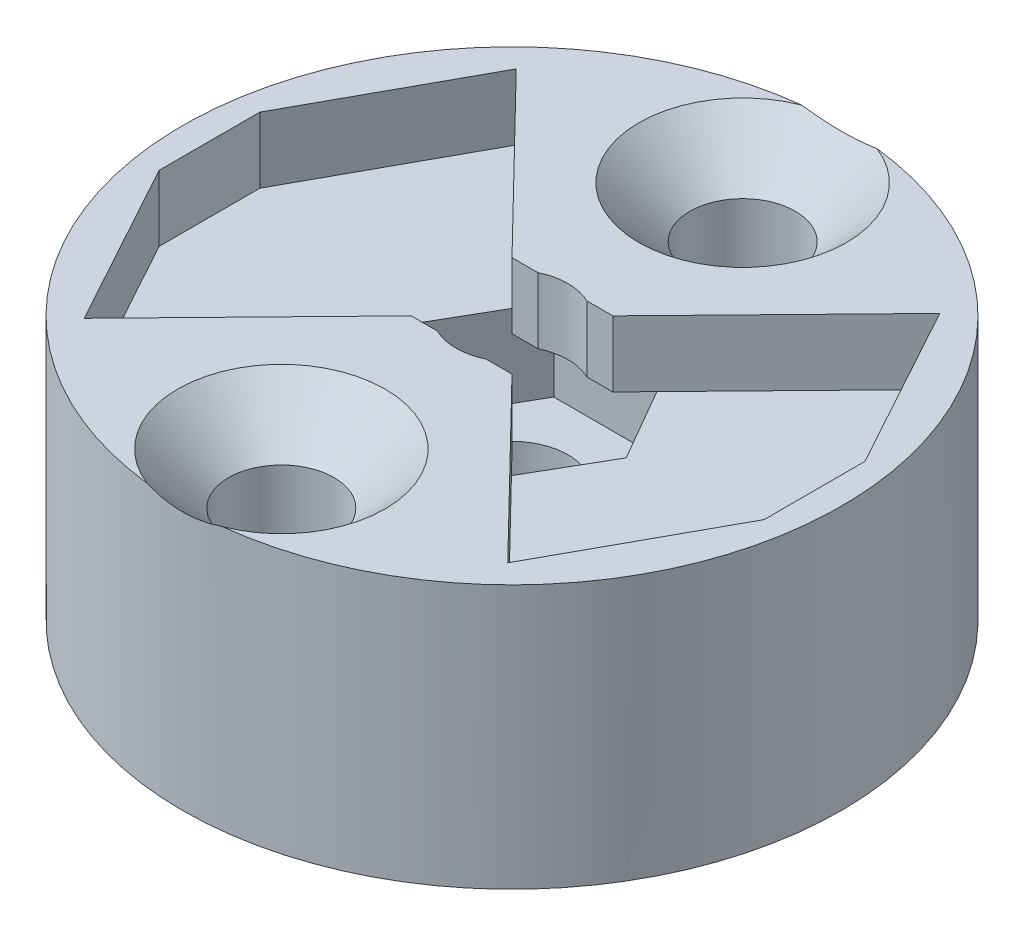
ISO-10303-21;
HEADER;
FILE_DESCRIPTION(('STEP AP214'),'2;1');
FILE_NAME('part.step','',(''),(''),'','','');
FILE_SCHEMA(('AUTOMOTIVE_DESIGN { 1 0 10303 214 1 1 1 1 }'));
ENDSEC;
DATA;
#1=APPLICATION_CONTEXT('core data for automotive mechanical design processes');
#2=APPLICATION_PROTOCOL_DEFINITION('international standard','automotive_design',2000,#1);
#3=PRODUCT_CONTEXT('',#1,'mechanical');
#4=PRODUCT('Part','Part','',(#3));
#5=PRODUCT_RELATED_PRODUCT_CATEGORY('part','',(#4));
#6=PRODUCT_DEFINITION_FORMATION('','',#4);
#7=PRODUCT_DEFINITION_CONTEXT('part definition',#1,'design');
#8=PRODUCT_DEFINITION('design','',#6,#7);
#9=PRODUCT_DEFINITION_SHAPE('','',#8);
#10=(LENGTH_UNIT() NAMED_UNIT(*) SI_UNIT(.MILLI.,.METRE.));
#11=(NAMED_UNIT(*) PLANE_ANGLE_UNIT() SI_UNIT($,.RADIAN.));
#12=(NAMED_UNIT(*) SI_UNIT($,.STERADIAN.) SOLID_ANGLE_UNIT());
#13=UNCERTAINTY_MEASURE_WITH_UNIT(LENGTH_MEASURE(1.E-05),#10,'distance_accuracy_value','');
#14=(GEOMETRIC_REPRESENTATION_CONTEXT(3) GLOBAL_UNCERTAINTY_ASSIGNED_CONTEXT((#13)) GLOBAL_UNIT_ASSIGNED_CONTEXT((#10,
#11,#12)) REPRESENTATION_CONTEXT('',''));
#15=CARTESIAN_POINT('',(0.,0.,0.));
#16=DIRECTION('',(0.,0.,1.));
#17=DIRECTION('',(1.,0.,0.));
#18=AXIS2_PLACEMENT_3D('',#15,#16,#17);
#19=CARTESIAN_POINT('',(1.53,6.,-1.53));
#20=DIRECTION('',(0.,0.,-1.));
#21=DIRECTION('',(-1.,0.,0.));
#22=AXIS2_PLACEMENT_3D('',#19,#20,#21);
#23=PLANE('',#22);
#24=DIRECTION('',(-1.,0.,0.));
#25=VECTOR('',#24,1.);
#26=CARTESIAN_POINT('',(1.53,6.,-1.53));
#27=LINE('',#26,#25);
#28=CARTESIAN_POINT('',(-0.741012820401914,6.,-1.53));
#29=VERTEX_POINT('',#28);
#30=CARTESIAN_POINT('',(-1.53,6.,-1.53));
#31=VERTEX_POINT('',#30);
#32=EDGE_CURVE('E271',#29,#31,#27,.T.);
#33=ORIENTED_EDGE('',*,*,#32,.F.);
#34=DIRECTION('',(0.,1.,0.));
#35=VECTOR('',#34,1.);
#36=CARTESIAN_POINT('',(-0.741012820401914,-0.999999999999999,-1.53));
#37=LINE('',#36,#35);
#38=CARTESIAN_POINT('',(-0.741012820401914,8.,-1.53));
#39=VERTEX_POINT('',#38);
#40=EDGE_CURVE('E668',#29,#39,#37,.T.);
#41=ORIENTED_EDGE('',*,*,#40,.T.);
#42=DIRECTION('',(-1.,0.,0.));
#43=VECTOR('',#42,1.);
#44=CARTESIAN_POINT('',(1.53,8.,-1.53));
#45=LINE('',#44,#43);
#46=CARTESIAN_POINT('',(-1.53,8.,-1.53));
#47=VERTEX_POINT('',#46);
#48=EDGE_CURVE('E519',#39,#47,#45,.T.);
#49=ORIENTED_EDGE('',*,*,#48,.T.);
#50=DIRECTION('',(0.,1.,0.));
#51=VECTOR('',#50,1.);
#52=CARTESIAN_POINT('',(-1.53,6.,-1.53));
#53=LINE('',#52,#51);
#54=EDGE_CURVE('E306',#31,#47,#53,.T.);
#55=ORIENTED_EDGE('',*,*,#54,.F.);
#56=EDGE_LOOP('',(#33,#41,#49,#55));
#57=FACE_BOUND('',#56,.T.);
#58=ADVANCED_FACE('F45',(#57),#23,.F.);
#59=CARTESIAN_POINT('',(-1.53,6.,1.53));
#60=DIRECTION('',(0.,0.,1.));
#61=DIRECTION('',(1.,0.,0.));
#62=AXIS2_PLACEMENT_3D('',#59,#60,#61);
#63=PLANE('',#62);
#64=DIRECTION('',(1.,0.,0.));
#65=VECTOR('',#64,1.);
#66=CARTESIAN_POINT('',(-1.53,6.,1.53));
#67=LINE('',#66,#65);
#68=CARTESIAN_POINT('',(0.741012820401914,6.,1.53));
#69=VERTEX_POINT('',#68);
#70=CARTESIAN_POINT('',(1.53,6.,1.53));
#71=VERTEX_POINT('',#70);
#72=EDGE_CURVE('E232',#69,#71,#67,.T.);
#73=ORIENTED_EDGE('',*,*,#72,.F.);
#74=DIRECTION('',(0.,1.,0.));
#75=VECTOR('',#74,1.);
#76=CARTESIAN_POINT('',(0.741012820401914,-0.999999999999999,1.53));
#77=LINE('',#76,#75);
#78=CARTESIAN_POINT('',(0.741012820401914,8.,1.53));
#79=VERTEX_POINT('',#78);
#80=EDGE_CURVE('E218',#69,#79,#77,.T.);
#81=ORIENTED_EDGE('',*,*,#80,.T.);
#82=DIRECTION('',(1.,0.,0.));
#83=VECTOR('',#82,1.);
#84=CARTESIAN_POINT('',(-1.53,8.,1.53));
#85=LINE('',#84,#83);
#86=CARTESIAN_POINT('',(1.53,8.,1.53));
#87=VERTEX_POINT('',#86);
#88=EDGE_CURVE('E230',#79,#87,#85,.T.);
#89=ORIENTED_EDGE('',*,*,#88,.T.);
#90=DIRECTION('',(0.,1.,0.));
#91=VECTOR('',#90,1.);
#92=CARTESIAN_POINT('',(1.53,6.,1.53));
#93=LINE('',#92,#91);
#94=EDGE_CURVE('E288',#71,#87,#93,.T.);
#95=ORIENTED_EDGE('',*,*,#94,.F.);
#96=EDGE_LOOP('',(#73,#81,#89,#95));
#97=FACE_BOUND('',#96,.T.);
#98=ADVANCED_FACE('F228',(#97),#63,.F.);
#99=CARTESIAN_POINT('',(0.,6.,0.));
#100=DIRECTION('',(0.,1.,0.));
#101=DIRECTION('',(0.,0.,1.));
#102=AXIS2_PLACEMENT_3D('',#99,#100,#101);
#103=PLANE('',#102);
#104=CARTESIAN_POINT('',(-1.53,6.,1.53));
#105=VERTEX_POINT('',#104);
#106=CARTESIAN_POINT('',(-0.741012820401914,6.,1.53));
#107=VERTEX_POINT('',#106);
#108=EDGE_CURVE('E570',#105,#107,#67,.T.);
#109=ORIENTED_EDGE('',*,*,#108,.T.);
#110=CARTESIAN_POINT('',(0.,6.,0.));
#111=DIRECTION('',(0.,1.,0.));
#112=DIRECTION('',(0.,0.,1.));
#113=AXIS2_PLACEMENT_3D('',#110,#111,#112);
#114=CIRCLE('',#113,1.7);
#115=EDGE_CURVE('E234',#107,#69,#114,.T.);
#116=ORIENTED_EDGE('',*,*,#115,.T.);
#117=ORIENTED_EDGE('',*,*,#72,.T.);
#118=DIRECTION('',(0.697851646705175,0.,0.716242332727462));
#119=VECTOR('',#118,1.);
#120=CARTESIAN_POINT('',(1.53,6.,1.53));
#121=LINE('',#120,#119);
#122=CARTESIAN_POINT('',(2.18978812414769,6.,2.20717571116525));
#123=VERTEX_POINT('',#122);
#124=EDGE_CURVE('E575',#71,#123,#121,.T.);
#125=ORIENTED_EDGE('',*,*,#124,.T.);
#126=DIRECTION('',(0.5,0.,-0.866025403784439));
#127=VECTOR('',#126,1.);
#128=CARTESIAN_POINT('',(1.73205080756888,6.,3.));
#129=LINE('',#128,#127);
#130=CARTESIAN_POINT('',(1.73205080756888,6.,3.));
#131=VERTEX_POINT('',#130);
#132=EDGE_CURVE('E365',#131,#123,#129,.T.);
#133=ORIENTED_EDGE('',*,*,#132,.F.);
#134=DIRECTION('',(1.,0.,0.));
#135=VECTOR('',#134,1.);
#136=CARTESIAN_POINT('',(-1.73205080756888,6.,3.));
#137=LINE('',#136,#135);
#138=CARTESIAN_POINT('',(-1.73205080756888,6.,3.));
#139=VERTEX_POINT('',#138);
#140=EDGE_CURVE('E344',#139,#131,#137,.T.);
#141=ORIENTED_EDGE('',*,*,#140,.F.);
#142=DIRECTION('',(0.5,0.,0.866025403784439));
#143=VECTOR('',#142,1.);
#144=CARTESIAN_POINT('',(-3.46410161513776,6.,0.));
#145=LINE('',#144,#143);
#146=CARTESIAN_POINT('',(-2.18978812414769,6.,2.20717571116525));
#147=VERTEX_POINT('',#146);
#148=EDGE_CURVE('E383',#147,#139,#145,.T.);
#149=ORIENTED_EDGE('',*,*,#148,.F.);
#150=DIRECTION('',(0.697851646705174,0.,-0.716242332727462));
#151=VECTOR('',#150,1.);
#152=CARTESIAN_POINT('',(-6.42640147085002,6.,6.55543775315246));
#153=LINE('',#152,#151);
#154=EDGE_CURVE('E552',#147,#105,#153,.T.);
#155=ORIENTED_EDGE('',*,*,#154,.T.);
#156=EDGE_LOOP('',(#109,#116,#117,#125,#133,#141,#149,#155));
#157=FACE_BOUND('',#156,.T.);
#158=ADVANCED_FACE('F452',(#157),#103,.F.);
#159=CARTESIAN_POINT('',(0.,3.5,0.));
#160=DIRECTION('',(0.,1.,0.));
#161=DIRECTION('',(0.,0.,1.));
#162=AXIS2_PLACEMENT_3D('',#159,#160,#161);
#163=PLANE('',#162);
#164=CARTESIAN_POINT('',(0.,3.5,0.));
#165=DIRECTION('',(0.,1.,0.));
#166=DIRECTION('',(0.,0.,1.));
#167=AXIS2_PLACEMENT_3D('',#164,#165,#166);
#168=CIRCLE('',#167,1.7);
#169=CARTESIAN_POINT('',(0.,3.5,1.7));
#170=VERTEX_POINT('',#169);
#171=EDGE_CURVE('E526',#170,#170,#168,.T.);
#172=ORIENTED_EDGE('',*,*,#171,.F.);
#173=EDGE_LOOP('',(#172));
#174=FACE_BOUND('',#173,.T.);
#175=DIRECTION('',(0.5,0.,-0.866025403784439));
#176=VECTOR('',#175,1.);
#177=CARTESIAN_POINT('',(1.73205080756888,3.5,3.));
#178=LINE('',#177,#176);
#179=CARTESIAN_POINT('',(1.73205080756888,3.5,3.));
#180=VERTEX_POINT('',#179);
#181=CARTESIAN_POINT('',(3.46410161513776,3.5,0.));
#182=VERTEX_POINT('',#181);
#183=EDGE_CURVE('E339',#180,#182,#178,.T.);
#184=ORIENTED_EDGE('',*,*,#183,.T.);
#185=DIRECTION('',(-0.5,0.,-0.866025403784439));
#186=VECTOR('',#185,1.);
#187=CARTESIAN_POINT('',(3.46410161513776,3.5,0.));
#188=LINE('',#187,#186);
#189=CARTESIAN_POINT('',(1.73205080756888,3.5,-3.));
#190=VERTEX_POINT('',#189);
#191=EDGE_CURVE('E343',#182,#190,#188,.T.);
#192=ORIENTED_EDGE('',*,*,#191,.T.);
#193=DIRECTION('',(-1.,0.,0.));
#194=VECTOR('',#193,1.);
#195=CARTESIAN_POINT('',(1.73205080756888,3.5,-3.));
#196=LINE('',#195,#194);
#197=CARTESIAN_POINT('',(-1.73205080756888,3.5,-3.));
#198=VERTEX_POINT('',#197);
#199=EDGE_CURVE('E348',#190,#198,#196,.T.);
#200=ORIENTED_EDGE('',*,*,#199,.T.);
#201=DIRECTION('',(-0.5,0.,0.866025403784439));
#202=VECTOR('',#201,1.);
#203=CARTESIAN_POINT('',(-1.73205080756888,3.5,-3.));
#204=LINE('',#203,#202);
#205=CARTESIAN_POINT('',(-3.46410161513776,3.5,0.));
#206=VERTEX_POINT('',#205);
#207=EDGE_CURVE('E352',#198,#206,#204,.T.);
#208=ORIENTED_EDGE('',*,*,#207,.T.);
#209=DIRECTION('',(0.5,0.,0.866025403784439));
#210=VECTOR('',#209,1.);
#211=CARTESIAN_POINT('',(-3.46410161513776,3.5,0.));
#212=LINE('',#211,#210);
#213=CARTESIAN_POINT('',(-1.73205080756888,3.5,3.));
#214=VERTEX_POINT('',#213);
#215=EDGE_CURVE('E356',#206,#214,#212,.T.);
#216=ORIENTED_EDGE('',*,*,#215,.T.);
#217=DIRECTION('',(1.,0.,0.));
#218=VECTOR('',#217,1.);
#219=CARTESIAN_POINT('',(-1.73205080756888,3.5,3.));
#220=LINE('',#219,#218);
#221=EDGE_CURVE('E360',#214,#180,#220,.T.);
#222=ORIENTED_EDGE('',*,*,#221,.T.);
#223=EDGE_LOOP('',(#184,#192,#200,#208,#216,#222));
#224=FACE_BOUND('',#223,.T.);
#225=ADVANCED_FACE('F453',(#174,#224),#163,.T.);
#226=CARTESIAN_POINT('',(3.46410161513776,3.5,0.));
#227=DIRECTION('',(0.866025403784439,0.,-0.5));
#228=DIRECTION('',(-0.5,0.,-0.866025403784439));
#229=AXIS2_PLACEMENT_3D('',#226,#227,#228);
#230=PLANE('',#229);
#231=DIRECTION('',(-0.5,0.,-0.866025403784439));
#232=VECTOR('',#231,1.);
#233=CARTESIAN_POINT('',(3.46410161513776,6.,0.));
#234=LINE('',#233,#232);
#235=CARTESIAN_POINT('',(3.46410161513776,6.,0.));
#236=VERTEX_POINT('',#235);
#237=CARTESIAN_POINT('',(2.18978812414769,6.,-2.20717571116525));
#238=VERTEX_POINT('',#237);
#239=EDGE_CURVE('E370',#236,#238,#234,.T.);
#240=ORIENTED_EDGE('',*,*,#239,.T.);
#241=CARTESIAN_POINT('',(1.73205080756888,6.,-3.));
#242=VERTEX_POINT('',#241);
#243=EDGE_CURVE('E369',#238,#242,#234,.T.);
#244=ORIENTED_EDGE('',*,*,#243,.T.);
#245=DIRECTION('',(0.,1.,0.));
#246=VECTOR('',#245,1.);
#247=CARTESIAN_POINT('',(1.73205080756888,3.5,-3.));
#248=LINE('',#247,#246);
#249=EDGE_CURVE('E408',#190,#242,#248,.T.);
#250=ORIENTED_EDGE('',*,*,#249,.F.);
#251=ORIENTED_EDGE('',*,*,#191,.F.);
#252=DIRECTION('',(0.,1.,0.));
#253=VECTOR('',#252,1.);
#254=CARTESIAN_POINT('',(3.46410161513776,3.5,0.));
#255=LINE('',#254,#253);
#256=EDGE_CURVE('E364',#182,#236,#255,.T.);
#257=ORIENTED_EDGE('',*,*,#256,.T.);
#258=EDGE_LOOP('',(#240,#244,#250,#251,#257));
#259=FACE_BOUND('',#258,.T.);
#260=ADVANCED_FACE('F456',(#259),#230,.F.);
#261=CARTESIAN_POINT('',(1.73205080756888,3.5,-3.));
#262=DIRECTION('',(0.,0.,-1.));
#263=DIRECTION('',(-1.,0.,0.));
#264=AXIS2_PLACEMENT_3D('',#261,#262,#263);
#265=PLANE('',#264);
#266=DIRECTION('',(-1.,0.,0.));
#267=VECTOR('',#266,1.);
#268=CARTESIAN_POINT('',(1.73205080756888,6.,-3.));
#269=LINE('',#268,#267);
#270=CARTESIAN_POINT('',(-1.73205080756888,6.,-3.));
#271=VERTEX_POINT('',#270);
#272=EDGE_CURVE('E374',#242,#271,#269,.T.);
#273=ORIENTED_EDGE('',*,*,#272,.T.);
#274=DIRECTION('',(0.,1.,0.));
#275=VECTOR('',#274,1.);
#276=CARTESIAN_POINT('',(-1.73205080756888,3.5,-3.));
#277=LINE('',#276,#275);
#278=EDGE_CURVE('E404',#198,#271,#277,.T.);
#279=ORIENTED_EDGE('',*,*,#278,.F.);
#280=ORIENTED_EDGE('',*,*,#199,.F.);
#281=ORIENTED_EDGE('',*,*,#249,.T.);
#282=EDGE_LOOP('',(#273,#279,#280,#281));
#283=FACE_BOUND('',#282,.T.);
#284=ADVANCED_FACE('F469',(#283),#265,.F.);
#285=CARTESIAN_POINT('',(-1.73205080756888,3.5,-3.));
#286=DIRECTION('',(-0.866025403784439,0.,-0.5));
#287=DIRECTION('',(-0.5,0.,0.866025403784439));
#288=AXIS2_PLACEMENT_3D('',#285,#286,#287);
#289=PLANE('',#288);
#290=DIRECTION('',(-0.5,0.,0.866025403784439));
#291=VECTOR('',#290,1.);
#292=CARTESIAN_POINT('',(-1.73205080756888,6.,-3.));
#293=LINE('',#292,#291);
#294=CARTESIAN_POINT('',(-2.18978812414769,6.,-2.20717571116525));
#295=VERTEX_POINT('',#294);
#296=EDGE_CURVE('E379',#271,#295,#293,.T.);
#297=ORIENTED_EDGE('',*,*,#296,.T.);
#298=CARTESIAN_POINT('',(-3.46410161513776,6.,0.));
#299=VERTEX_POINT('',#298);
#300=EDGE_CURVE('E378',#295,#299,#293,.T.);
#301=ORIENTED_EDGE('',*,*,#300,.T.);
#302=DIRECTION('',(0.,1.,0.));
#303=VECTOR('',#302,1.);
#304=CARTESIAN_POINT('',(-3.46410161513776,3.5,0.));
#305=LINE('',#304,#303);
#306=EDGE_CURVE('E400',#206,#299,#305,.T.);
#307=ORIENTED_EDGE('',*,*,#306,.F.);
#308=ORIENTED_EDGE('',*,*,#207,.F.);
#309=ORIENTED_EDGE('',*,*,#278,.T.);
#310=EDGE_LOOP('',(#297,#301,#307,#308,#309));
#311=FACE_BOUND('',#310,.T.);
#312=ADVANCED_FACE('F465',(#311),#289,.F.);
#313=CARTESIAN_POINT('',(-3.46410161513776,3.5,0.));
#314=DIRECTION('',(-0.866025403784439,0.,0.5));
#315=DIRECTION('',(0.5,0.,0.866025403784439));
#316=AXIS2_PLACEMENT_3D('',#313,#314,#315);
#317=PLANE('',#316);
#318=EDGE_CURVE('E384',#299,#147,#145,.T.);
#319=ORIENTED_EDGE('',*,*,#318,.T.);
#320=ORIENTED_EDGE('',*,*,#148,.T.);
#321=DIRECTION('',(0.,1.,0.));
#322=VECTOR('',#321,1.);
#323=CARTESIAN_POINT('',(-1.73205080756888,3.5,3.));
#324=LINE('',#323,#322);
#325=EDGE_CURVE('E396',#214,#139,#324,.T.);
#326=ORIENTED_EDGE('',*,*,#325,.F.);
#327=ORIENTED_EDGE('',*,*,#215,.F.);
#328=ORIENTED_EDGE('',*,*,#306,.T.);
#329=EDGE_LOOP('',(#319,#320,#326,#327,#328));
#330=FACE_BOUND('',#329,.T.);
#331=ADVANCED_FACE('F461',(#330),#317,.F.);
#332=CARTESIAN_POINT('',(-1.73205080756888,3.5,3.));
#333=DIRECTION('',(0.,0.,1.));
#334=DIRECTION('',(1.,0.,0.));
#335=AXIS2_PLACEMENT_3D('',#332,#333,#334);
#336=PLANE('',#335);
#337=ORIENTED_EDGE('',*,*,#140,.T.);
#338=DIRECTION('',(0.,1.,0.));
#339=VECTOR('',#338,1.);
#340=CARTESIAN_POINT('',(1.73205080756888,3.5,3.));
#341=LINE('',#340,#339);
#342=EDGE_CURVE('E391',#180,#131,#341,.T.);
#343=ORIENTED_EDGE('',*,*,#342,.F.);
#344=ORIENTED_EDGE('',*,*,#221,.F.);
#345=ORIENTED_EDGE('',*,*,#325,.T.);
#346=EDGE_LOOP('',(#337,#343,#344,#345));
#347=FACE_BOUND('',#346,.T.);
#348=ADVANCED_FACE('F458',(#347),#336,.F.);
#349=CARTESIAN_POINT('',(1.73205080756888,3.5,3.));
#350=DIRECTION('',(0.866025403784439,0.,0.5));
#351=DIRECTION('',(0.5,0.,-0.866025403784439));
#352=AXIS2_PLACEMENT_3D('',#349,#350,#351);
#353=PLANE('',#352);
#354=ORIENTED_EDGE('',*,*,#132,.T.);
#355=EDGE_CURVE('E338',#123,#236,#129,.T.);
#356=ORIENTED_EDGE('',*,*,#355,.T.);
#357=ORIENTED_EDGE('',*,*,#256,.F.);
#358=ORIENTED_EDGE('',*,*,#183,.F.);
#359=ORIENTED_EDGE('',*,*,#342,.T.);
#360=EDGE_LOOP('',(#354,#356,#357,#358,#359));
#361=FACE_BOUND('',#360,.T.);
#362=ADVANCED_FACE('F450',(#361),#353,.F.);
#363=CARTESIAN_POINT('',(1.53,6.,-1.53));
#364=VERTEX_POINT('',#363);
#365=CARTESIAN_POINT('',(0.741012820401914,6.,-1.53));
#366=VERTEX_POINT('',#365);
#367=EDGE_CURVE('E641',#364,#366,#27,.T.);
#368=ORIENTED_EDGE('',*,*,#367,.T.);
#369=CARTESIAN_POINT('',(0.,6.,0.));
#370=DIRECTION('',(0.,1.,0.));
#371=DIRECTION('',(0.,0.,1.));
#372=AXIS2_PLACEMENT_3D('',#369,#370,#371);
#373=CIRCLE('',#372,1.7);
#374=EDGE_CURVE('E670',#366,#29,#373,.T.);
#375=ORIENTED_EDGE('',*,*,#374,.T.);
#376=ORIENTED_EDGE('',*,*,#32,.T.);
#377=DIRECTION('',(-0.697851646705174,0.,-0.716242332727462));
#378=VECTOR('',#377,1.);
#379=CARTESIAN_POINT('',(-1.53,6.,-1.53));
#380=LINE('',#379,#378);
#381=EDGE_CURVE('E648',#31,#295,#380,.T.);
#382=ORIENTED_EDGE('',*,*,#381,.T.);
#383=ORIENTED_EDGE('',*,*,#296,.F.);
#384=ORIENTED_EDGE('',*,*,#272,.F.);
#385=ORIENTED_EDGE('',*,*,#243,.F.);
#386=DIRECTION('',(-0.697851646705175,0.,0.716242332727462));
#387=VECTOR('',#386,1.);
#388=CARTESIAN_POINT('',(6.42640147085003,6.,-6.55543775315246));
#389=LINE('',#388,#387);
#390=EDGE_CURVE('E589',#238,#364,#389,.T.);
#391=ORIENTED_EDGE('',*,*,#390,.T.);
#392=EDGE_LOOP('',(#368,#375,#376,#382,#383,#384,#385,#391));
#393=FACE_BOUND('',#392,.T.);
#394=ADVANCED_FACE('F446',(#393),#103,.F.);
#395=CARTESIAN_POINT('',(0.,6.,0.));
#396=DIRECTION('',(0.,1.,0.));
#397=DIRECTION('',(0.,0.,1.));
#398=AXIS2_PLACEMENT_3D('',#395,#396,#397);
#399=PLANE('',#398);
#400=ORIENTED_EDGE('',*,*,#300,.F.);
#401=CARTESIAN_POINT('',(-6.42640147085002,6.,-6.55543775315246));
#402=VERTEX_POINT('',#401);
#403=EDGE_CURVE('E644',#295,#402,#380,.T.);
#404=ORIENTED_EDGE('',*,*,#403,.T.);
#405=DIRECTION('',(-0.480525794873226,0.,0.876980592978804));
#406=VECTOR('',#405,1.);
#407=CARTESIAN_POINT('',(-6.42640147085002,6.,-6.55543775315246));
#408=LINE('',#407,#406);
#409=CARTESIAN_POINT('',(-9.18,6.,-1.53));
#410=VERTEX_POINT('',#409);
#411=EDGE_CURVE('E566',#402,#410,#408,.T.);
#412=ORIENTED_EDGE('',*,*,#411,.T.);
#413=DIRECTION('',(0.,0.,1.));
#414=VECTOR('',#413,1.);
#415=CARTESIAN_POINT('',(-9.18,6.,-1.53));
#416=LINE('',#415,#414);
#417=CARTESIAN_POINT('',(-9.18,6.,1.53));
#418=VERTEX_POINT('',#417);
#419=EDGE_CURVE('E561',#410,#418,#416,.T.);
#420=ORIENTED_EDGE('',*,*,#419,.T.);
#421=DIRECTION('',(0.480525794873226,0.,0.876980592978804));
#422=VECTOR('',#421,1.);
#423=CARTESIAN_POINT('',(-9.18,6.,1.53));
#424=LINE('',#423,#422);
#425=CARTESIAN_POINT('',(-6.42640147085002,6.,6.55543775315246));
#426=VERTEX_POINT('',#425);
#427=EDGE_CURVE('E557',#418,#426,#424,.T.);
#428=ORIENTED_EDGE('',*,*,#427,.T.);
#429=EDGE_CURVE('E549',#426,#147,#153,.T.);
#430=ORIENTED_EDGE('',*,*,#429,.T.);
#431=ORIENTED_EDGE('',*,*,#318,.F.);
#432=EDGE_LOOP('',(#400,#404,#412,#420,#428,#430,#431));
#433=FACE_BOUND('',#432,.T.);
#434=ADVANCED_FACE('F449',(#433),#399,.T.);
#435=CARTESIAN_POINT('',(1.53,8.,-1.53));
#436=VERTEX_POINT('',#435);
#437=CARTESIAN_POINT('',(0.741012820401914,8.,-1.53));
#438=VERTEX_POINT('',#437);
#439=EDGE_CURVE('E513',#436,#438,#45,.T.);
#440=ORIENTED_EDGE('',*,*,#439,.T.);
#441=DIRECTION('',(0.,1.,0.));
#442=VECTOR('',#441,1.);
#443=CARTESIAN_POINT('',(0.741012820401914,-0.999999999999999,-1.53));
#444=LINE('',#443,#442);
#445=EDGE_CURVE('E69',#438,#366,#444,.F.);
#446=ORIENTED_EDGE('',*,*,#445,.T.);
#447=ORIENTED_EDGE('',*,*,#367,.F.);
#448=DIRECTION('',(0.,1.,0.));
#449=VECTOR('',#448,1.);
#450=CARTESIAN_POINT('',(1.53,6.,-1.53));
#451=LINE('',#450,#449);
#452=EDGE_CURVE('E272',#364,#436,#451,.T.);
#453=ORIENTED_EDGE('',*,*,#452,.T.);
#454=EDGE_LOOP('',(#440,#446,#447,#453));
#455=FACE_BOUND('',#454,.T.);
#456=ADVANCED_FACE('F491',(#455),#23,.F.);
#457=CARTESIAN_POINT('',(6.42640147085003,6.,-6.55543775315246));
#458=DIRECTION('',(-0.716242332727462,0.,-0.697851646705175));
#459=DIRECTION('',(-0.697851646705175,0.,0.716242332727462));
#460=AXIS2_PLACEMENT_3D('',#457,#458,#459);
#461=PLANE('',#460);
#462=DIRECTION('',(-0.697851646705175,0.,0.716242332727462));
#463=VECTOR('',#462,1.);
#464=CARTESIAN_POINT('',(6.42640147085003,8.,-6.55543775315246));
#465=LINE('',#464,#463);
#466=CARTESIAN_POINT('',(6.42640147085003,8.,-6.55543775315246));
#467=VERTEX_POINT('',#466);
#468=EDGE_CURVE('E267',#467,#436,#465,.T.);
#469=ORIENTED_EDGE('',*,*,#468,.T.);
#470=ORIENTED_EDGE('',*,*,#452,.F.);
#471=ORIENTED_EDGE('',*,*,#390,.F.);
#472=CARTESIAN_POINT('',(6.42640147085003,6.,-6.55543775315246));
#473=VERTEX_POINT('',#472);
#474=EDGE_CURVE('E310',#473,#238,#389,.T.);
#475=ORIENTED_EDGE('',*,*,#474,.F.);
#476=DIRECTION('',(0.,1.,0.));
#477=VECTOR('',#476,1.);
#478=CARTESIAN_POINT('',(6.42640147085003,6.,-6.55543775315246));
#479=LINE('',#478,#477);
#480=EDGE_CURVE('E276',#473,#467,#479,.T.);
#481=ORIENTED_EDGE('',*,*,#480,.T.);
#482=EDGE_LOOP('',(#469,#470,#471,#475,#481));
#483=FACE_BOUND('',#482,.T.);
#484=ADVANCED_FACE('F500',(#483),#461,.F.);
#485=CARTESIAN_POINT('',(9.18,6.,-1.53));
#486=DIRECTION('',(0.876980592978804,0.,-0.480525794873226));
#487=DIRECTION('',(-0.480525794873226,0.,-0.876980592978804));
#488=AXIS2_PLACEMENT_3D('',#485,#486,#487);
#489=PLANE('',#488);
#490=DIRECTION('',(-0.480525794873226,0.,-0.876980592978804));
#491=VECTOR('',#490,1.);
#492=CARTESIAN_POINT('',(9.18,8.,-1.53));
#493=LINE('',#492,#491);
#494=CARTESIAN_POINT('',(9.18,8.,-1.53));
#495=VERTEX_POINT('',#494);
#496=EDGE_CURVE('E263',#495,#467,#493,.T.);
#497=ORIENTED_EDGE('',*,*,#496,.T.);
#498=ORIENTED_EDGE('',*,*,#480,.F.);
#499=DIRECTION('',(-0.480525794873226,0.,-0.876980592978804));
#500=VECTOR('',#499,1.);
#501=CARTESIAN_POINT('',(9.18,6.,-1.53));
#502=LINE('',#501,#500);
#503=CARTESIAN_POINT('',(9.18,6.,-1.53));
#504=VERTEX_POINT('',#503);
#505=EDGE_CURVE('E586',#504,#473,#502,.T.);
#506=ORIENTED_EDGE('',*,*,#505,.F.);
#507=DIRECTION('',(0.,1.,0.));
#508=VECTOR('',#507,1.);
#509=CARTESIAN_POINT('',(9.18,6.,-1.53));
#510=LINE('',#509,#508);
#511=EDGE_CURVE('E279',#504,#495,#510,.T.);
#512=ORIENTED_EDGE('',*,*,#511,.T.);
#513=EDGE_LOOP('',(#497,#498,#506,#512));
#514=FACE_BOUND('',#513,.T.);
#515=ADVANCED_FACE('F506',(#514),#489,.F.);
#516=CARTESIAN_POINT('',(9.18,6.,1.53));
#517=DIRECTION('',(1.,0.,0.));
#518=DIRECTION('',(0.,0.,-1.));
#519=AXIS2_PLACEMENT_3D('',#516,#517,#518);
#520=PLANE('',#519);
#521=DIRECTION('',(0.,0.,-1.));
#522=VECTOR('',#521,1.);
#523=CARTESIAN_POINT('',(9.18,8.,1.53));
#524=LINE('',#523,#522);
#525=CARTESIAN_POINT('',(9.18,8.,1.53));
#526=VERTEX_POINT('',#525);
#527=EDGE_CURVE('E259',#526,#495,#524,.T.);
#528=ORIENTED_EDGE('',*,*,#527,.T.);
#529=ORIENTED_EDGE('',*,*,#511,.F.);
#530=DIRECTION('',(0.,0.,-1.));
#531=VECTOR('',#530,1.);
#532=CARTESIAN_POINT('',(9.18,6.,1.53));
#533=LINE('',#532,#531);
#534=CARTESIAN_POINT('',(9.18,6.,1.53));
#535=VERTEX_POINT('',#534);
#536=EDGE_CURVE('E583',#535,#504,#533,.T.);
#537=ORIENTED_EDGE('',*,*,#536,.F.);
#538=DIRECTION('',(0.,1.,0.));
#539=VECTOR('',#538,1.);
#540=CARTESIAN_POINT('',(9.18,6.,1.53));
#541=LINE('',#540,#539);
#542=EDGE_CURVE('E282',#535,#526,#541,.T.);
#543=ORIENTED_EDGE('',*,*,#542,.T.);
#544=EDGE_LOOP('',(#528,#529,#537,#543));
#545=FACE_BOUND('',#544,.T.);
#546=ADVANCED_FACE('F638',(#545),#520,.F.);
#547=CARTESIAN_POINT('',(6.42640147085003,6.,6.55543775315246));
#548=DIRECTION('',(0.876980592978804,0.,0.480525794873226));
#549=DIRECTION('',(0.480525794873226,0.,-0.876980592978804));
#550=AXIS2_PLACEMENT_3D('',#547,#548,#549);
#551=PLANE('',#550);
#552=DIRECTION('',(0.480525794873226,0.,-0.876980592978804));
#553=VECTOR('',#552,1.);
#554=CARTESIAN_POINT('',(6.42640147085003,8.,6.55543775315246));
#555=LINE('',#554,#553);
#556=CARTESIAN_POINT('',(6.42640147085003,8.,6.55543775315246));
#557=VERTEX_POINT('',#556);
#558=EDGE_CURVE('E255',#557,#526,#555,.T.);
#559=ORIENTED_EDGE('',*,*,#558,.T.);
#560=ORIENTED_EDGE('',*,*,#542,.F.);
#561=DIRECTION('',(0.480525794873226,0.,-0.876980592978804));
#562=VECTOR('',#561,1.);
#563=CARTESIAN_POINT('',(6.42640147085003,6.,6.55543775315246));
#564=LINE('',#563,#562);
#565=CARTESIAN_POINT('',(6.42640147085003,6.,6.55543775315246));
#566=VERTEX_POINT('',#565);
#567=EDGE_CURVE('E579',#566,#535,#564,.T.);
#568=ORIENTED_EDGE('',*,*,#567,.F.);
#569=DIRECTION('',(0.,1.,0.));
#570=VECTOR('',#569,1.);
#571=CARTESIAN_POINT('',(6.42640147085003,6.,6.55543775315246));
#572=LINE('',#571,#570);
#573=EDGE_CURVE('E285',#566,#557,#572,.T.);
#574=ORIENTED_EDGE('',*,*,#573,.T.);
#575=EDGE_LOOP('',(#559,#560,#568,#574));
#576=FACE_BOUND('',#575,.T.);
#577=ADVANCED_FACE('F635',(#576),#551,.F.);
#578=CARTESIAN_POINT('',(1.53,6.,1.53));
#579=DIRECTION('',(-0.716242332727462,0.,0.697851646705175));
#580=DIRECTION('',(0.697851646705175,0.,0.716242332727462));
#581=AXIS2_PLACEMENT_3D('',#578,#579,#580);
#582=PLANE('',#581);
#583=DIRECTION('',(0.697851646705175,0.,0.716242332727462));
#584=VECTOR('',#583,1.);
#585=CARTESIAN_POINT('',(1.53,8.,1.53));
#586=LINE('',#585,#584);
#587=EDGE_CURVE('E241',#87,#557,#586,.T.);
#588=ORIENTED_EDGE('',*,*,#587,.T.);
#589=ORIENTED_EDGE('',*,*,#573,.F.);
#590=EDGE_CURVE('E574',#123,#566,#121,.T.);
#591=ORIENTED_EDGE('',*,*,#590,.F.);
#592=ORIENTED_EDGE('',*,*,#124,.F.);
#593=ORIENTED_EDGE('',*,*,#94,.T.);
#594=EDGE_LOOP('',(#588,#589,#591,#592,#593));
#595=FACE_BOUND('',#594,.T.);
#596=ADVANCED_FACE('F628',(#595),#582,.F.);
#597=CARTESIAN_POINT('',(-1.53,8.,1.53));
#598=VERTEX_POINT('',#597);
#599=CARTESIAN_POINT('',(-0.741012820401914,8.,1.53));
#600=VERTEX_POINT('',#599);
#601=EDGE_CURVE('E243',#598,#600,#85,.T.);
#602=ORIENTED_EDGE('',*,*,#601,.T.);
#603=DIRECTION('',(0.,1.,0.));
#604=VECTOR('',#603,1.);
#605=CARTESIAN_POINT('',(-0.741012820401914,-0.999999999999999,1.53));
#606=LINE('',#605,#604);
#607=EDGE_CURVE('E62',#600,#107,#606,.F.);
#608=ORIENTED_EDGE('',*,*,#607,.T.);
#609=ORIENTED_EDGE('',*,*,#108,.F.);
#610=DIRECTION('',(0.,1.,0.));
#611=VECTOR('',#610,1.);
#612=CARTESIAN_POINT('',(-1.53,6.,1.53));
#613=LINE('',#612,#611);
#614=EDGE_CURVE('E291',#105,#598,#613,.T.);
#615=ORIENTED_EDGE('',*,*,#614,.T.);
#616=EDGE_LOOP('',(#602,#608,#609,#615));
#617=FACE_BOUND('',#616,.T.);
#618=ADVANCED_FACE('F496',(#617),#63,.F.);
#619=CARTESIAN_POINT('',(-6.42640147085002,6.,6.55543775315246));
#620=DIRECTION('',(0.716242332727462,0.,0.697851646705174));
#621=DIRECTION('',(0.697851646705174,0.,-0.716242332727462));
#622=AXIS2_PLACEMENT_3D('',#619,#620,#621);
#623=PLANE('',#622);
#624=DIRECTION('',(0.697851646705174,0.,-0.716242332727462));
#625=VECTOR('',#624,1.);
#626=CARTESIAN_POINT('',(-6.42640147085002,8.,6.55543775315246));
#627=LINE('',#626,#625);
#628=CARTESIAN_POINT('',(-6.42640147085002,8.,6.55543775315246));
#629=VERTEX_POINT('',#628);
#630=EDGE_CURVE('E244',#629,#598,#627,.T.);
#631=ORIENTED_EDGE('',*,*,#630,.T.);
#632=ORIENTED_EDGE('',*,*,#614,.F.);
#633=ORIENTED_EDGE('',*,*,#154,.F.);
#634=ORIENTED_EDGE('',*,*,#429,.F.);
#635=DIRECTION('',(0.,1.,0.));
#636=VECTOR('',#635,1.);
#637=CARTESIAN_POINT('',(-6.42640147085002,6.,6.55543775315246));
#638=LINE('',#637,#636);
#639=EDGE_CURVE('E294',#426,#629,#638,.T.);
#640=ORIENTED_EDGE('',*,*,#639,.T.);
#641=EDGE_LOOP('',(#631,#632,#633,#634,#640));
#642=FACE_BOUND('',#641,.T.);
#643=ADVANCED_FACE('F546',(#642),#623,.F.);
#644=CARTESIAN_POINT('',(-9.18,6.,1.53));
#645=DIRECTION('',(-0.876980592978804,0.,0.480525794873226));
#646=DIRECTION('',(0.480525794873226,0.,0.876980592978804));
#647=AXIS2_PLACEMENT_3D('',#644,#645,#646);
#648=PLANE('',#647);
#649=DIRECTION('',(0.480525794873226,0.,0.876980592978804));
#650=VECTOR('',#649,1.);
#651=CARTESIAN_POINT('',(-9.18,8.,1.53));
#652=LINE('',#651,#650);
#653=CARTESIAN_POINT('',(-9.18,8.,1.53));
#654=VERTEX_POINT('',#653);
#655=EDGE_CURVE('E249',#654,#629,#652,.T.);
#656=ORIENTED_EDGE('',*,*,#655,.T.);
#657=ORIENTED_EDGE('',*,*,#639,.F.);
#658=ORIENTED_EDGE('',*,*,#427,.F.);
#659=DIRECTION('',(0.,1.,0.));
#660=VECTOR('',#659,1.);
#661=CARTESIAN_POINT('',(-9.18,6.,1.53));
#662=LINE('',#661,#660);
#663=EDGE_CURVE('E297',#418,#654,#662,.T.);
#664=ORIENTED_EDGE('',*,*,#663,.T.);
#665=EDGE_LOOP('',(#656,#657,#658,#664));
#666=FACE_BOUND('',#665,.T.);
#667=ADVANCED_FACE('F541',(#666),#648,.F.);
#668=CARTESIAN_POINT('',(-9.18,6.,-1.53));
#669=DIRECTION('',(-1.,0.,0.));
#670=DIRECTION('',(0.,0.,1.));
#671=AXIS2_PLACEMENT_3D('',#668,#669,#670);
#672=PLANE('',#671);
#673=DIRECTION('',(0.,0.,1.));
#674=VECTOR('',#673,1.);
#675=CARTESIAN_POINT('',(-9.18,8.,-1.53));
#676=LINE('',#675,#674);
#677=CARTESIAN_POINT('',(-9.18,8.,-1.53));
#678=VERTEX_POINT('',#677);
#679=EDGE_CURVE('E533',#678,#654,#676,.T.);
#680=ORIENTED_EDGE('',*,*,#679,.T.);
#681=ORIENTED_EDGE('',*,*,#663,.F.);
#682=ORIENTED_EDGE('',*,*,#419,.F.);
#683=DIRECTION('',(0.,1.,0.));
#684=VECTOR('',#683,1.);
#685=CARTESIAN_POINT('',(-9.18,6.,-1.53));
#686=LINE('',#685,#684);
#687=EDGE_CURVE('E300',#410,#678,#686,.T.);
#688=ORIENTED_EDGE('',*,*,#687,.T.);
#689=EDGE_LOOP('',(#680,#681,#682,#688));
#690=FACE_BOUND('',#689,.T.);
#691=ADVANCED_FACE('F660',(#690),#672,.F.);
#692=CARTESIAN_POINT('',(-6.42640147085002,6.,-6.55543775315246));
#693=DIRECTION('',(-0.876980592978804,0.,-0.480525794873226));
#694=DIRECTION('',(-0.480525794873226,0.,0.876980592978804));
#695=AXIS2_PLACEMENT_3D('',#692,#693,#694);
#696=PLANE('',#695);
#697=DIRECTION('',(-0.480525794873226,0.,0.876980592978804));
#698=VECTOR('',#697,1.);
#699=CARTESIAN_POINT('',(-6.42640147085002,8.,-6.55543775315246));
#700=LINE('',#699,#698);
#701=CARTESIAN_POINT('',(-6.42640147085002,8.,-6.55543775315246));
#702=VERTEX_POINT('',#701);
#703=EDGE_CURVE('E524',#702,#678,#700,.T.);
#704=ORIENTED_EDGE('',*,*,#703,.T.);
#705=ORIENTED_EDGE('',*,*,#687,.F.);
#706=ORIENTED_EDGE('',*,*,#411,.F.);
#707=DIRECTION('',(0.,1.,0.));
#708=VECTOR('',#707,1.);
#709=CARTESIAN_POINT('',(-6.42640147085002,6.,-6.55543775315246));
#710=LINE('',#709,#708);
#711=EDGE_CURVE('E303',#402,#702,#710,.T.);
#712=ORIENTED_EDGE('',*,*,#711,.T.);
#713=EDGE_LOOP('',(#704,#705,#706,#712));
#714=FACE_BOUND('',#713,.T.);
#715=ADVANCED_FACE('F657',(#714),#696,.F.);
#716=CARTESIAN_POINT('',(-1.53,6.,-1.53));
#717=DIRECTION('',(0.716242332727462,0.,-0.697851646705174));
#718=DIRECTION('',(-0.697851646705175,0.,-0.716242332727462));
#719=AXIS2_PLACEMENT_3D('',#716,#717,#718);
#720=PLANE('',#719);
#721=DIRECTION('',(-0.697851646705174,0.,-0.716242332727462));
#722=VECTOR('',#721,1.);
#723=CARTESIAN_POINT('',(-1.53,8.,-1.53));
#724=LINE('',#723,#722);
#725=EDGE_CURVE('E518',#47,#702,#724,.T.);
#726=ORIENTED_EDGE('',*,*,#725,.T.);
#727=ORIENTED_EDGE('',*,*,#711,.F.);
#728=ORIENTED_EDGE('',*,*,#403,.F.);
#729=ORIENTED_EDGE('',*,*,#381,.F.);
#730=ORIENTED_EDGE('',*,*,#54,.T.);
#731=EDGE_LOOP('',(#726,#727,#728,#729,#730));
#732=FACE_BOUND('',#731,.T.);
#733=ADVANCED_FACE('F664',(#732),#720,.F.);
#734=ORIENTED_EDGE('',*,*,#590,.T.);
#735=ORIENTED_EDGE('',*,*,#567,.T.);
#736=ORIENTED_EDGE('',*,*,#536,.T.);
#737=ORIENTED_EDGE('',*,*,#505,.T.);
#738=ORIENTED_EDGE('',*,*,#474,.T.);
#739=ORIENTED_EDGE('',*,*,#239,.F.);
#740=ORIENTED_EDGE('',*,*,#355,.F.);
#741=EDGE_LOOP('',(#734,#735,#736,#737,#738,#739,#740));
#742=FACE_BOUND('',#741,.T.);
#743=ADVANCED_FACE('F484',(#742),#399,.T.);
#744=CARTESIAN_POINT('',(0.,6.,0.));
#745=DIRECTION('',(0.,-1.,0.));
#746=DIRECTION('',(0.,0.,-1.));
#747=AXIS2_PLACEMENT_3D('',#744,#745,#746);
#748=CYLINDRICAL_SURFACE('',#747,10.);
#749=CARTESIAN_POINT('',(0.,0.,0.));
#750=DIRECTION('',(0.,1.,0.));
#751=DIRECTION('',(0.,0.,1.));
#752=AXIS2_PLACEMENT_3D('',#749,#750,#751);
#753=CIRCLE('',#752,10.);
#754=CARTESIAN_POINT('',(0.,0.,10.));
#755=VERTEX_POINT('',#754);
#756=EDGE_CURVE('E395',#755,#755,#753,.T.);
#757=ORIENTED_EDGE('',*,*,#756,.T.);
#758=EDGE_LOOP('',(#757));
#759=FACE_BOUND('',#758,.T.);
#760=CARTESIAN_POINT('',(0.,8.,0.));
#761=DIRECTION('',(0.,1.,0.));
#762=DIRECTION('',(0.,0.,1.));
#763=AXIS2_PLACEMENT_3D('',#760,#761,#762);
#764=CIRCLE('',#763,10.);
#765=CARTESIAN_POINT('',(-1.14608694008556,8.,-9.93410714285715));
#766=VERTEX_POINT('',#765);
#767=CARTESIAN_POINT('',(-1.14608694008555,8.,9.93410714285714));
#768=VERTEX_POINT('',#767);
#769=EDGE_CURVE('E333',#766,#768,#764,.T.);
#770=ORIENTED_EDGE('',*,*,#769,.F.);
#771=CARTESIAN_POINT('',(-4.15357293527946,9.50272292492595,-9.09658352741918));
#772=CARTESIAN_POINT('',(-4.0627265322508,9.44032520393799,-9.13806207604852));
#773=CARTESIAN_POINT('',(-3.97094112167142,9.37848049131662,-9.17833000233902));
#774=CARTESIAN_POINT('',(-3.7854035718385,9.25615303883607,-9.25639584339107));
#775=CARTESIAN_POINT('',(-3.69165103324637,9.19567058079217,-9.29419325008675));
#776=CARTESIAN_POINT('',(-3.50168541854889,9.07607094056159,-9.36742272772741));
#777=CARTESIAN_POINT('',(-3.40546290056121,9.01696144816969,-9.40284293541655));
#778=CARTESIAN_POINT('',(-3.21089856059933,8.90076648254001,-9.47104805231966));
#779=CARTESIAN_POINT('',(-3.11255687746923,8.84368087734493,-9.50383313352096));
#780=CARTESIAN_POINT('',(-2.81374236208876,8.67581098616808,-9.59826110174204));
#781=CARTESIAN_POINT('',(-2.60988188401412,8.56867051171125,-9.65582079289995));
#782=CARTESIAN_POINT('',(-2.19254558741352,8.3690080364027,-9.75903668356614));
#783=CARTESIAN_POINT('',(-1.97909202580812,8.27645423675257,-9.80471892122828));
#784=CARTESIAN_POINT('',(-1.71046953715711,8.17591683172856,-9.8527597822105));
#785=CARTESIAN_POINT('',(-1.66015987223712,8.1577511801695,-9.86136374475285));
#786=CARTESIAN_POINT('',(-1.55899801065481,8.12265052321827,-9.87786173461513));
#787=CARTESIAN_POINT('',(-1.50814582580024,8.10571549110451,-9.8857557773511));
#788=CARTESIAN_POINT('',(-1.35468973954973,8.05688030615633,-9.90835572400048));
#789=CARTESIAN_POINT('',(-1.25127332385101,8.02698299008832,-9.9219638135585));
#790=CARTESIAN_POINT('',(-1.02993396070429,7.97020368281454,-9.94751658132029));
#791=CARTESIAN_POINT('',(-0.911759182634136,7.9441138115991,-9.95906580992988));
#792=CARTESIAN_POINT('',(-0.673397228428004,7.90093912381904,-9.97801720516824));
#793=CARTESIAN_POINT('',(-0.553209648065427,7.88385613901602,-9.98541852824238));
#794=CARTESIAN_POINT('',(-0.31173943635341,7.85964788767465,-9.99586929575353));
#795=CARTESIAN_POINT('',(-0.190457902606252,7.8525135618334,-9.99892269948318));
#796=CARTESIAN_POINT('',(0.0522608147869209,7.8486004235908,-10.0005998339108));
#797=CARTESIAN_POINT('',(0.173697934689101,7.85181823108385,-9.9992250104822));
#798=CARTESIAN_POINT('',(0.438888094913275,7.87000686668772,-9.99140453697502));
#799=CARTESIAN_POINT('',(0.582469753228963,7.88710669461704,-9.98403983937412));
#800=CARTESIAN_POINT('',(0.866915693036007,7.93436686359098,-9.96337307104582));
#801=CARTESIAN_POINT('',(1.00778109345263,7.96452170132513,-9.95007350207773));
#802=CARTESIAN_POINT('',(1.25676175547247,8.02839027918484,-9.92133062336453));
#803=CARTESIAN_POINT('',(1.36554565450613,8.0600288323694,-9.90692305210322));
#804=CARTESIAN_POINT('',(1.65992636142465,8.15461729076329,-9.86307747481116));
#805=CARTESIAN_POINT('',(1.8431497535633,8.22347755174663,-9.83038010358818));
#806=CARTESIAN_POINT('',(2.20261383274872,8.37416098722861,-9.75614070281735));
#807=CARTESIAN_POINT('',(2.37883974985718,8.45600992987669,-9.71458103386009));
#808=CARTESIAN_POINT('',(2.63822892813408,8.58578940674323,-9.646126481772));
#809=CARTESIAN_POINT('',(2.72396117851918,8.63027119210166,-9.62225865818299));
#810=CARTESIAN_POINT('',(2.89379790548185,8.72121769030426,-9.57255269475367));
#811=CARTESIAN_POINT('',(2.97790228375434,8.76768252236237,-9.54671443638393));
#812=CARTESIAN_POINT('',(3.14419216702414,8.86208457282774,-9.49324248736753));
#813=CARTESIAN_POINT('',(3.22638426275732,8.91001476439339,-9.46561681836273));
#814=CARTESIAN_POINT('',(3.38925824802863,9.00728380967124,-9.40852618672016));
#815=CARTESIAN_POINT('',(3.46994045095007,9.05662236558168,-9.37906161138262));
#816=CARTESIAN_POINT('',(3.54990719249823,9.10655077893152,-9.3486982475984));
#817=B_SPLINE_CURVE_WITH_KNOTS('',3,(#771,#772,#773,#774,#775,#776,#777,#778,#779,#780,#781,
#782,#783,#784,#785,#786,#787,#788,#789,#790,#791,#792,#793,#794,#795,#796,#797,#798,#799,#800,
#801,#802,#803,#804,#805,#806,#807,#808,#809,#810,#811,#812,#813,#814,#815,#816),.UNSPECIFIED.,
.F.,.F.,(4,2,2,2,2,2,2,2,2,2,2,2,2,2,2,2,2,2,2,2,2,2,4),(0.,0.353270523348895,0.706613470173775,
1.06160559498607,1.41657453161025,2.12801431298417,2.83788104508417,3.00039413655005,
3.16290369816112,3.48820541233952,3.8525356595334,4.2169399732752,4.58101224130042,
4.94496564708146,5.37848816584809,5.81182811183068,6.15422039265021,6.74853082119453,
7.34403538718546,7.64246340410584,7.94090938683055,8.23809818372133,8.53522459821563),.UNSPECIFIED.);
#818=CARTESIAN_POINT('',(1.14608694008556,8.,-9.93410714285714));
#819=VERTEX_POINT('',#818);
#820=EDGE_CURVE('E225',#766,#819,#817,.T.);
#821=ORIENTED_EDGE('',*,*,#820,.T.);
#822=CARTESIAN_POINT('',(1.14608694008556,8.,9.93410714285715));
#823=VERTEX_POINT('',#822);
#824=EDGE_CURVE('E334',#823,#819,#764,.T.);
#825=ORIENTED_EDGE('',*,*,#824,.F.);
#826=CARTESIAN_POINT('',(3.54990719249823,9.10655077893152,9.3486982475984));
#827=CARTESIAN_POINT('',(3.45975577936805,9.05026786960139,9.38292775068366));
#828=CARTESIAN_POINT('',(3.36869565494695,8.99472871182867,9.41601610665303));
#829=CARTESIAN_POINT('',(3.18463949676507,8.8854740685912,9.47985112424187));
#830=CARTESIAN_POINT('',(3.09164285766025,8.83175916761467,9.51059703919855));
#831=CARTESIAN_POINT('',(2.90299540714188,8.72615766927997,9.56987235988887));
#832=CARTESIAN_POINT('',(2.80733058876867,8.67428647269955,9.5983847736477));
#833=CARTESIAN_POINT('',(2.61388322702022,8.57323862617444,9.65286040073443));
#834=CARTESIAN_POINT('',(2.51610085853093,8.52406175488383,9.67882382360783));
#835=CARTESIAN_POINT('',(2.31601450419608,8.427854016064,9.72866613252043));
#836=CARTESIAN_POINT('',(2.21365824680248,8.38089885191149,9.75248309362193));
#837=CARTESIAN_POINT('',(2.00653044082234,8.29111277669205,9.79719740111159));
#838=CARTESIAN_POINT('',(1.90175849857709,8.2482825437938,9.81809426766878));
#839=CARTESIAN_POINT('',(1.58428783672914,8.1274834374282,9.87603876718179));
#840=CARTESIAN_POINT('',(1.36773934683337,8.0568602102663,9.90851592904106));
#841=CARTESIAN_POINT('',(1.02944608514134,7.97007818229428,9.94757414630425));
#842=CARTESIAN_POINT('',(0.910803294958448,7.94390262055556,9.95915959531026));
#843=CARTESIAN_POINT('',(0.671488119347764,7.90063180102988,9.97815100264119));
#844=CARTESIAN_POINT('',(0.550815540134891,7.88353741536241,9.98555655955042));
#845=CARTESIAN_POINT('',(0.309333656065256,7.85948653327537,9.99593849341355));
#846=CARTESIAN_POINT('',(0.188534869620623,7.85244227637267,9.99895321722406));
#847=CARTESIAN_POINT('',(-0.0532187608533523,7.84862575047874,10.0005890162639));
#848=CARTESIAN_POINT('',(-0.174173553388693,7.85185068297511,9.9992112885039));
#849=CARTESIAN_POINT('',(-0.438735195044697,7.8699965821282,9.99140868279491));
#850=CARTESIAN_POINT('',(-0.582170177373692,7.88707125804005,9.9840538950572));
#851=CARTESIAN_POINT('',(-0.86660223549906,7.93430043575951,9.96340355456149));
#852=CARTESIAN_POINT('',(-1.00759465619857,7.96447755108825,9.95009772969882));
#853=CARTESIAN_POINT('',(-1.44671391356608,8.07710893990599,9.89939630227821));
#854=CARTESIAN_POINT('',(-1.73858715793436,8.17972177131062,9.85191379388961));
#855=CARTESIAN_POINT('',(-2.16279388849936,8.35743116438203,9.76439527584467));
#856=CARTESIAN_POINT('',(-2.30227767111587,8.42083099214907,9.73240085323372));
#857=CARTESIAN_POINT('',(-2.57698117833135,8.55382702833423,9.66329024314922));
#858=CARTESIAN_POINT('',(-2.71220195298721,8.62342169444429,9.62617532924878));
#859=CARTESIAN_POINT('',(-2.96057463819589,8.7576181591937,9.55245745551835));
#860=CARTESIAN_POINT('',(-3.07423768537708,8.82162204226574,9.51646427453445));
#861=CARTESIAN_POINT('',(-3.2987365380694,8.95248388606057,9.44099334901394));
#862=CARTESIAN_POINT('',(-3.40957222201735,9.01934196917108,9.40151545497565));
#863=CARTESIAN_POINT('',(-3.62739222853647,9.15462070312016,9.3196258754145));
#864=CARTESIAN_POINT('',(-3.73440488885533,9.22301734428229,9.27724964064153));
#865=CARTESIAN_POINT('',(-3.94587228517165,9.36161521879331,9.18929693852406));
#866=CARTESIAN_POINT('',(-4.05032771034715,9.43181595524563,9.14372134650571));
#867=CARTESIAN_POINT('',(-4.15357293527946,9.50272292492595,9.09658352741918));
#868=B_SPLINE_CURVE_WITH_KNOTS('',3,(#826,#827,#828,#829,#830,#831,#832,#833,#834,#835,#836,
#837,#838,#839,#840,#841,#842,#843,#844,#845,#846,#847,#848,#849,#850,#851,#852,#853,#854,#855,
#856,#857,#858,#859,#860,#861,#862,#863,#864,#865,#866,#867),.UNSPECIFIED.,.F.,.F.,(4,2,2,2,2,2,
2,2,2,2,2,2,2,2,2,2,2,2,2,2,4),(0.,0.334964287287985,0.670034902956063,1.00744719713696,
1.34483173031574,1.69000139923311,2.03522772002324,2.72330255504065,3.08909831631779,
3.45492920079509,3.81754557647285,4.18006314205699,4.61311921275914,5.0469256852544,
5.98089289468014,6.45035218639227,6.91969492357568,7.32555443739841,7.73143137193888,
8.13301496602815,8.53448911412598),.UNSPECIFIED.);
#869=EDGE_CURVE('E418',#823,#768,#868,.T.);
#870=ORIENTED_EDGE('',*,*,#869,.T.);
#871=EDGE_LOOP('',(#770,#821,#825,#870));
#872=FACE_BOUND('',#871,.T.);
#873=ADVANCED_FACE('F47',(#759,#872),#748,.T.);
#874=CARTESIAN_POINT('',(0.,0.,0.));
#875=DIRECTION('',(0.,1.,0.));
#876=DIRECTION('',(0.,0.,1.));
#877=AXIS2_PLACEMENT_3D('',#874,#875,#876);
#878=PLANE('',#877);
#879=CARTESIAN_POINT('',(0.,0.,0.));
#880=DIRECTION('',(0.,1.,0.));
#881=DIRECTION('',(0.,0.,1.));
#882=AXIS2_PLACEMENT_3D('',#879,#880,#881);
#883=CIRCLE('',#882,1.7);
#884=CARTESIAN_POINT('',(0.,0.,1.7));
#885=VERTEX_POINT('',#884);
#886=EDGE_CURVE('E682',#885,#885,#883,.T.);
#887=ORIENTED_EDGE('',*,*,#886,.T.);
#888=EDGE_LOOP('',(#887));
#889=FACE_BOUND('',#888,.T.);
#890=CARTESIAN_POINT('',(0.,0.,-7.));
#891=DIRECTION('',(0.,1.,0.));
#892=DIRECTION('',(0.,0.,1.));
#893=AXIS2_PLACEMENT_3D('',#890,#891,#892);
#894=CIRCLE('',#893,1.6);
#895=CARTESIAN_POINT('',(0.,0.,-5.4));
#896=VERTEX_POINT('',#895);
#897=EDGE_CURVE('E317',#896,#896,#894,.T.);
#898=ORIENTED_EDGE('',*,*,#897,.T.);
#899=EDGE_LOOP('',(#898));
#900=FACE_BOUND('',#899,.T.);
#901=CARTESIAN_POINT('',(0.,0.,7.));
#902=DIRECTION('',(0.,1.,0.));
#903=DIRECTION('',(0.,0.,1.));
#904=AXIS2_PLACEMENT_3D('',#901,#902,#903);
#905=CIRCLE('',#904,1.6);
#906=CARTESIAN_POINT('',(0.,0.,8.6));
#907=VERTEX_POINT('',#906);
#908=EDGE_CURVE('E329',#907,#907,#905,.T.);
#909=ORIENTED_EDGE('',*,*,#908,.T.);
#910=EDGE_LOOP('',(#909));
#911=FACE_BOUND('',#910,.T.);
#912=ORIENTED_EDGE('',*,*,#756,.F.);
#913=EDGE_LOOP('',(#912));
#914=FACE_BOUND('',#913,.T.);
#915=ADVANCED_FACE('F445',(#889,#900,#911,#914),#878,.F.);
#916=CARTESIAN_POINT('',(0.,8.,0.));
#917=DIRECTION('',(0.,1.,0.));
#918=DIRECTION('',(0.,0.,1.));
#919=AXIS2_PLACEMENT_3D('',#916,#917,#918);
#920=PLANE('',#919);
#921=CARTESIAN_POINT('',(0.,8.,0.));
#922=DIRECTION('',(0.,1.,0.));
#923=DIRECTION('',(0.,0.,1.));
#924=AXIS2_PLACEMENT_3D('',#921,#922,#923);
#925=CIRCLE('',#924,1.7);
#926=EDGE_CURVE('E11',#438,#39,#925,.T.);
#927=ORIENTED_EDGE('',*,*,#926,.F.);
#928=ORIENTED_EDGE('',*,*,#439,.F.);
#929=ORIENTED_EDGE('',*,*,#468,.F.);
#930=ORIENTED_EDGE('',*,*,#496,.F.);
#931=ORIENTED_EDGE('',*,*,#527,.F.);
#932=ORIENTED_EDGE('',*,*,#558,.F.);
#933=ORIENTED_EDGE('',*,*,#587,.F.);
#934=ORIENTED_EDGE('',*,*,#88,.F.);
#935=EDGE_CURVE('E50',#600,#79,#925,.T.);
#936=ORIENTED_EDGE('',*,*,#935,.F.);
#937=ORIENTED_EDGE('',*,*,#601,.F.);
#938=ORIENTED_EDGE('',*,*,#630,.F.);
#939=ORIENTED_EDGE('',*,*,#655,.F.);
#940=ORIENTED_EDGE('',*,*,#679,.F.);
#941=ORIENTED_EDGE('',*,*,#703,.F.);
#942=ORIENTED_EDGE('',*,*,#725,.F.);
#943=ORIENTED_EDGE('',*,*,#48,.F.);
#944=EDGE_LOOP('',(#927,#928,#929,#930,#931,#932,#933,#934,#936,#937,#938,#939,#940,#941,#942,#943));
#945=FACE_BOUND('',#944,.T.);
#946=CARTESIAN_POINT('',(0.,8.,-7.));
#947=DIRECTION('',(0.,1.,0.));
#948=DIRECTION('',(0.,0.,1.));
#949=AXIS2_PLACEMENT_3D('',#946,#947,#948);
#950=CIRCLE('',#949,3.15);
#951=EDGE_CURVE('E275',#766,#819,#950,.T.);
#952=ORIENTED_EDGE('',*,*,#951,.F.);
#953=ORIENTED_EDGE('',*,*,#769,.T.);
#954=CARTESIAN_POINT('',(0.,8.,7.));
#955=DIRECTION('',(0.,1.,0.));
#956=DIRECTION('',(0.,0.,1.));
#957=AXIS2_PLACEMENT_3D('',#954,#955,#956);
#958=CIRCLE('',#957,3.15);
#959=EDGE_CURVE('E321',#823,#768,#958,.T.);
#960=ORIENTED_EDGE('',*,*,#959,.F.);
#961=ORIENTED_EDGE('',*,*,#824,.T.);
#962=EDGE_LOOP('',(#952,#953,#960,#961));
#963=FACE_BOUND('',#962,.T.);
#964=ADVANCED_FACE('F237',(#945,#963),#920,.T.);
#965=CARTESIAN_POINT('',(0.,8.,7.));
#966=DIRECTION('',(0.,1.,0.));
#967=DIRECTION('',(0.,0.,1.));
#968=AXIS2_PLACEMENT_3D('',#965,#966,#967);
#969=CONICAL_SURFACE('',#968,3.15,0.785398163397447);
#970=CARTESIAN_POINT('',(0.,6.45,7.));
#971=DIRECTION('',(0.,1.,0.));
#972=DIRECTION('',(0.,0.,1.));
#973=AXIS2_PLACEMENT_3D('',#970,#971,#972);
#974=CIRCLE('',#973,1.6);
#975=CARTESIAN_POINT('',(0.,6.45,8.6));
#976=VERTEX_POINT('',#975);
#977=EDGE_CURVE('E325',#976,#976,#974,.T.);
#978=ORIENTED_EDGE('',*,*,#977,.F.);
#979=EDGE_LOOP('',(#978));
#980=FACE_BOUND('',#979,.T.);
#981=ORIENTED_EDGE('',*,*,#959,.T.);
#982=ORIENTED_EDGE('',*,*,#869,.F.);
#983=EDGE_LOOP('',(#981,#982));
#984=FACE_BOUND('',#983,.T.);
#985=ADVANCED_FACE('F431',(#980,#984),#969,.F.);
#986=CARTESIAN_POINT('',(0.,8.,7.));
#987=DIRECTION('',(0.,1.,0.));
#988=DIRECTION('',(0.,0.,1.));
#989=AXIS2_PLACEMENT_3D('',#986,#987,#988);
#990=CYLINDRICAL_SURFACE('',#989,1.6);
#991=ORIENTED_EDGE('',*,*,#908,.F.);
#992=EDGE_LOOP('',(#991));
#993=FACE_BOUND('',#992,.T.);
#994=ORIENTED_EDGE('',*,*,#977,.T.);
#995=EDGE_LOOP('',(#994));
#996=FACE_BOUND('',#995,.T.);
#997=ADVANCED_FACE('F436',(#993,#996),#990,.F.);
#998=CARTESIAN_POINT('',(0.,8.,-7.));
#999=DIRECTION('',(0.,1.,0.));
#1000=DIRECTION('',(0.,0.,1.));
#1001=AXIS2_PLACEMENT_3D('',#998,#999,#1000);
#1002=CONICAL_SURFACE('',#1001,3.15,0.785398163397447);
#1003=CARTESIAN_POINT('',(0.,6.45,-7.));
#1004=DIRECTION('',(0.,1.,0.));
#1005=DIRECTION('',(0.,0.,1.));
#1006=AXIS2_PLACEMENT_3D('',#1003,#1004,#1005);
#1007=CIRCLE('',#1006,1.6);
#1008=CARTESIAN_POINT('',(0.,6.45,-5.4));
#1009=VERTEX_POINT('',#1008);
#1010=EDGE_CURVE('E313',#1009,#1009,#1007,.T.);
#1011=ORIENTED_EDGE('',*,*,#1010,.F.);
#1012=EDGE_LOOP('',(#1011));
#1013=FACE_BOUND('',#1012,.T.);
#1014=ORIENTED_EDGE('',*,*,#951,.T.);
#1015=ORIENTED_EDGE('',*,*,#820,.F.);
#1016=EDGE_LOOP('',(#1014,#1015));
#1017=FACE_BOUND('',#1016,.T.);
#1018=ADVANCED_FACE('F441',(#1013,#1017),#1002,.F.);
#1019=CARTESIAN_POINT('',(0.,8.,-7.));
#1020=DIRECTION('',(0.,1.,0.));
#1021=DIRECTION('',(0.,0.,1.));
#1022=AXIS2_PLACEMENT_3D('',#1019,#1020,#1021);
#1023=CYLINDRICAL_SURFACE('',#1022,1.6);
#1024=ORIENTED_EDGE('',*,*,#897,.F.);
#1025=EDGE_LOOP('',(#1024));
#1026=FACE_BOUND('',#1025,.T.);
#1027=ORIENTED_EDGE('',*,*,#1010,.T.);
#1028=EDGE_LOOP('',(#1027));
#1029=FACE_BOUND('',#1028,.T.);
#1030=ADVANCED_FACE('F438',(#1026,#1029),#1023,.F.);
#1031=CARTESIAN_POINT('',(0.,-0.999999999999999,0.));
#1032=DIRECTION('',(0.,1.,0.));
#1033=DIRECTION('',(0.,0.,1.));
#1034=AXIS2_PLACEMENT_3D('',#1031,#1032,#1033);
#1035=CYLINDRICAL_SURFACE('',#1034,1.7);
#1036=ORIENTED_EDGE('',*,*,#115,.F.);
#1037=ORIENTED_EDGE('',*,*,#607,.F.);
#1038=ORIENTED_EDGE('',*,*,#935,.T.);
#1039=ORIENTED_EDGE('',*,*,#80,.F.);
#1040=EDGE_LOOP('',(#1036,#1037,#1038,#1039));
#1041=FACE_BOUND('',#1040,.T.);
#1042=ADVANCED_FACE('F217',(#1041),#1035,.F.);
#1043=ORIENTED_EDGE('',*,*,#374,.F.);
#1044=ORIENTED_EDGE('',*,*,#445,.F.);
#1045=ORIENTED_EDGE('',*,*,#926,.T.);
#1046=ORIENTED_EDGE('',*,*,#40,.F.);
#1047=EDGE_LOOP('',(#1043,#1044,#1045,#1046));
#1048=FACE_BOUND('',#1047,.T.);
#1049=ADVANCED_FACE('F688',(#1048),#1035,.F.);
#1050=ORIENTED_EDGE('',*,*,#171,.T.);
#1051=EDGE_LOOP('',(#1050));
#1052=FACE_BOUND('',#1051,.T.);
#1053=ORIENTED_EDGE('',*,*,#886,.F.);
#1054=EDGE_LOOP('',(#1053));
#1055=FACE_BOUND('',#1054,.T.);
#1056=ADVANCED_FACE('F686',(#1052,#1055),#1035,.F.);
#1057=CLOSED_SHELL('',(#58,#98,#158,#225,#260,#284,#312,#331,#348,#362,#394,#434,#456,#484,#515,
#546,#577,#596,#618,#643,#667,#691,#715,#733,#743,#873,#915,#964,#985,#997,#1018,#1030,#1042,
#1049,#1056));
#1058=MANIFOLD_SOLID_BREP('B2',#1057);
#1059=ADVANCED_BREP_SHAPE_REPRESENTATION('',(#18,#1058),#14);
#1060=SHAPE_DEFINITION_REPRESENTATION(#9,#1059);
ENDSEC;
END-ISO-10303-21;
